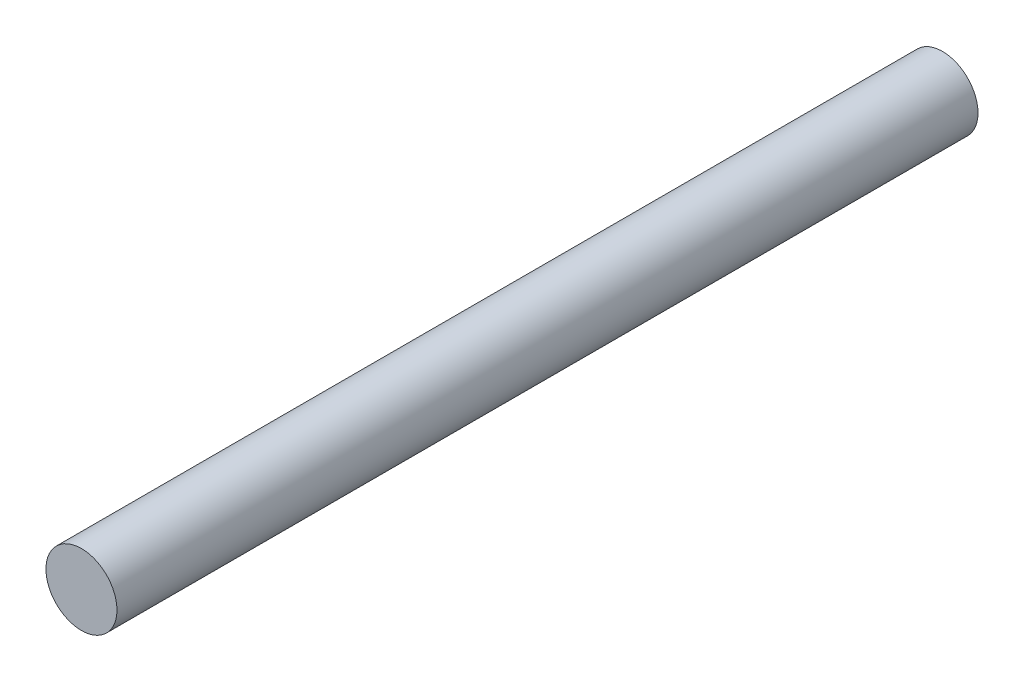
ISO-10303-21;
HEADER;
FILE_DESCRIPTION(('STEP AP214'),'2;1');
FILE_NAME('part.step','',(''),(''),'','','');
FILE_SCHEMA(('AUTOMOTIVE_DESIGN { 1 0 10303 214 1 1 1 1 }'));
ENDSEC;
DATA;
#1=APPLICATION_CONTEXT('core data for automotive mechanical design processes');
#2=APPLICATION_PROTOCOL_DEFINITION('international standard','automotive_design',2000,#1);
#3=PRODUCT_CONTEXT('',#1,'mechanical');
#4=PRODUCT('Part','Part','',(#3));
#5=PRODUCT_RELATED_PRODUCT_CATEGORY('part','',(#4));
#6=PRODUCT_DEFINITION_FORMATION('','',#4);
#7=PRODUCT_DEFINITION_CONTEXT('part definition',#1,'design');
#8=PRODUCT_DEFINITION('design','',#6,#7);
#9=PRODUCT_DEFINITION_SHAPE('','',#8);
#10=(LENGTH_UNIT() NAMED_UNIT(*) SI_UNIT(.MILLI.,.METRE.));
#11=(NAMED_UNIT(*) PLANE_ANGLE_UNIT() SI_UNIT($,.RADIAN.));
#12=(NAMED_UNIT(*) SI_UNIT($,.STERADIAN.) SOLID_ANGLE_UNIT());
#13=UNCERTAINTY_MEASURE_WITH_UNIT(LENGTH_MEASURE(1.E-05),#10,'distance_accuracy_value','');
#14=(GEOMETRIC_REPRESENTATION_CONTEXT(3) GLOBAL_UNCERTAINTY_ASSIGNED_CONTEXT((#13)) GLOBAL_UNIT_ASSIGNED_CONTEXT((#10,
#11,#12)) REPRESENTATION_CONTEXT('',''));
#15=CARTESIAN_POINT('',(0.,0.,0.));
#16=DIRECTION('',(0.,0.,1.));
#17=DIRECTION('',(1.,0.,0.));
#18=AXIS2_PLACEMENT_3D('',#15,#16,#17);
#19=CARTESIAN_POINT('',(0.,0.,40.));
#20=DIRECTION('',(0.,0.,-1.));
#21=DIRECTION('',(-1.,0.,0.));
#22=AXIS2_PLACEMENT_3D('',#19,#20,#21);
#23=CYLINDRICAL_SURFACE('',#22,1.65);
#24=CARTESIAN_POINT('',(0.,0.,40.));
#25=DIRECTION('',(0.,0.,1.));
#26=DIRECTION('',(1.,0.,0.));
#27=AXIS2_PLACEMENT_3D('',#24,#25,#26);
#28=CIRCLE('',#27,1.65);
#29=CARTESIAN_POINT('',(1.65,0.,40.));
#30=VERTEX_POINT('',#29);
#31=EDGE_CURVE('E10',#30,#30,#28,.T.);
#32=ORIENTED_EDGE('',*,*,#31,.F.);
#33=EDGE_LOOP('',(#32));
#34=FACE_BOUND('',#33,.T.);
#35=CARTESIAN_POINT('',(0.,0.,0.));
#36=DIRECTION('',(0.,0.,1.));
#37=DIRECTION('',(1.,0.,0.));
#38=AXIS2_PLACEMENT_3D('',#35,#36,#37);
#39=CIRCLE('',#38,1.65);
#40=CARTESIAN_POINT('',(1.65,0.,0.));
#41=VERTEX_POINT('',#40);
#42=EDGE_CURVE('E33',#41,#41,#39,.T.);
#43=ORIENTED_EDGE('',*,*,#42,.T.);
#44=EDGE_LOOP('',(#43));
#45=FACE_BOUND('',#44,.T.);
#46=ADVANCED_FACE('F30',(#34,#45),#23,.T.);
#47=CARTESIAN_POINT('',(0.,0.,40.));
#48=DIRECTION('',(0.,0.,1.));
#49=DIRECTION('',(1.,0.,0.));
#50=AXIS2_PLACEMENT_3D('',#47,#48,#49);
#51=PLANE('',#50);
#52=ORIENTED_EDGE('',*,*,#31,.T.);
#53=EDGE_LOOP('',(#52));
#54=FACE_BOUND('',#53,.T.);
#55=ADVANCED_FACE('F45',(#54),#51,.T.);
#56=CARTESIAN_POINT('',(0.,0.,0.));
#57=DIRECTION('',(0.,0.,1.));
#58=DIRECTION('',(1.,0.,0.));
#59=AXIS2_PLACEMENT_3D('',#56,#57,#58);
#60=PLANE('',#59);
#61=ORIENTED_EDGE('',*,*,#42,.F.);
#62=EDGE_LOOP('',(#61));
#63=FACE_BOUND('',#62,.T.);
#64=ADVANCED_FACE('F43',(#63),#60,.F.);
#65=CLOSED_SHELL('',(#46,#55,#64));
#66=MANIFOLD_SOLID_BREP('B2',#65);
#67=ADVANCED_BREP_SHAPE_REPRESENTATION('',(#18,#66),#14);
#68=SHAPE_DEFINITION_REPRESENTATION(#9,#67);
ENDSEC;
END-ISO-10303-21;
